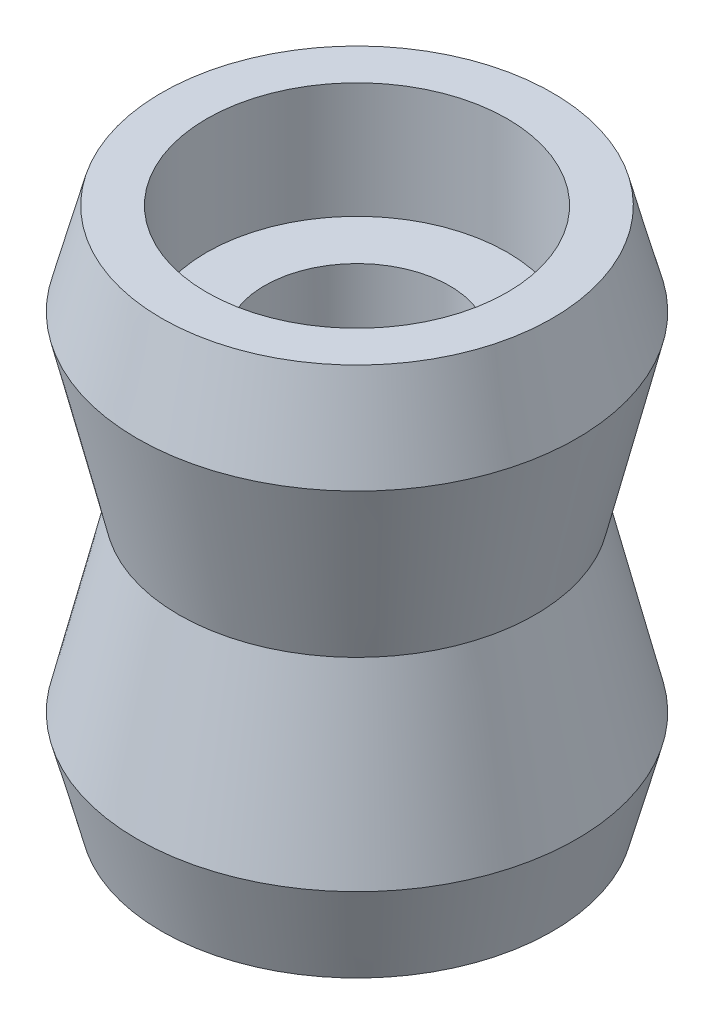
ISO-10303-21;
HEADER;
FILE_DESCRIPTION(('STEP AP214'),'2;1');
FILE_NAME('part.step','',(''),(''),'','','');
FILE_SCHEMA(('AUTOMOTIVE_DESIGN { 1 0 10303 214 1 1 1 1 }'));
ENDSEC;
DATA;
#1=APPLICATION_CONTEXT('core data for automotive mechanical design processes');
#2=APPLICATION_PROTOCOL_DEFINITION('international standard','automotive_design',2000,#1);
#3=PRODUCT_CONTEXT('',#1,'mechanical');
#4=PRODUCT('Part','Part','',(#3));
#5=PRODUCT_RELATED_PRODUCT_CATEGORY('part','',(#4));
#6=PRODUCT_DEFINITION_FORMATION('','',#4);
#7=PRODUCT_DEFINITION_CONTEXT('part definition',#1,'design');
#8=PRODUCT_DEFINITION('design','',#6,#7);
#9=PRODUCT_DEFINITION_SHAPE('','',#8);
#10=(LENGTH_UNIT() NAMED_UNIT(*) SI_UNIT(.MILLI.,.METRE.));
#11=(NAMED_UNIT(*) PLANE_ANGLE_UNIT() SI_UNIT($,.RADIAN.));
#12=(NAMED_UNIT(*) SI_UNIT($,.STERADIAN.) SOLID_ANGLE_UNIT());
#13=UNCERTAINTY_MEASURE_WITH_UNIT(LENGTH_MEASURE(1.E-05),#10,'distance_accuracy_value','');
#14=(GEOMETRIC_REPRESENTATION_CONTEXT(3) GLOBAL_UNCERTAINTY_ASSIGNED_CONTEXT((#13)) GLOBAL_UNIT_ASSIGNED_CONTEXT((#10,
#11,#12)) REPRESENTATION_CONTEXT('',''));
#15=CARTESIAN_POINT('',(0.,0.,0.));
#16=DIRECTION('',(0.,0.,1.));
#17=DIRECTION('',(1.,0.,0.));
#18=AXIS2_PLACEMENT_3D('',#15,#16,#17);
#19=CARTESIAN_POINT('',(0.,42.3234558477177,0.));
#20=DIRECTION('',(0.,1.,0.));
#21=DIRECTION('',(0.,0.,1.));
#22=AXIS2_PLACEMENT_3D('',#19,#20,#21);
#23=CYLINDRICAL_SURFACE('',#22,4.);
#24=CARTESIAN_POINT('',(0.,9.66900053684746,0.));
#25=DIRECTION('',(0.,1.,0.));
#26=DIRECTION('',(0.,0.,1.));
#27=AXIS2_PLACEMENT_3D('',#24,#25,#26);
#28=CIRCLE('',#27,4.);
#29=CARTESIAN_POINT('',(0.,9.66900053684746,4.));
#30=VERTEX_POINT('',#29);
#31=EDGE_CURVE('E63',#30,#30,#28,.T.);
#32=ORIENTED_EDGE('',*,*,#31,.T.);
#33=EDGE_LOOP('',(#32));
#34=FACE_BOUND('',#33,.T.);
#35=CARTESIAN_POINT('',(0.,-3.08436697366508,0.));
#36=DIRECTION('',(0.,-1.,0.));
#37=DIRECTION('',(0.,0.,-1.));
#38=AXIS2_PLACEMENT_3D('',#35,#36,#37);
#39=CIRCLE('',#38,4.);
#40=CARTESIAN_POINT('',(0.,-3.08436697366508,-4.));
#41=VERTEX_POINT('',#40);
#42=EDGE_CURVE('E10',#41,#41,#39,.F.);
#43=ORIENTED_EDGE('',*,*,#42,.F.);
#44=EDGE_LOOP('',(#43));
#45=FACE_BOUND('',#44,.T.);
#46=ADVANCED_FACE('F39',(#34,#45),#23,.F.);
#47=CARTESIAN_POINT('',(0.,-8.28436697366508,0.));
#48=DIRECTION('',(0.,1.,0.));
#49=DIRECTION('',(0.,0.,1.));
#50=AXIS2_PLACEMENT_3D('',#47,#48,#49);
#51=CONICAL_SURFACE('',#50,8.44834512402877,0.258536651886108);
#52=CARTESIAN_POINT('',(0.,-4.30768321840881,0.));
#53=DIRECTION('',(0.,1.,0.));
#54=DIRECTION('',(0.,0.,1.));
#55=AXIS2_PLACEMENT_3D('',#52,#53,#54);
#56=CIRCLE('',#55,9.5);
#57=CARTESIAN_POINT('',(0.,-4.30768321840881,9.5));
#58=VERTEX_POINT('',#57);
#59=EDGE_CURVE('E87',#58,#58,#56,.T.);
#60=ORIENTED_EDGE('',*,*,#59,.F.);
#61=EDGE_LOOP('',(#60));
#62=FACE_BOUND('',#61,.T.);
#63=CARTESIAN_POINT('',(0.,-8.28436697366508,0.));
#64=DIRECTION('',(0.,1.,0.));
#65=DIRECTION('',(0.,0.,1.));
#66=AXIS2_PLACEMENT_3D('',#63,#64,#65);
#67=CIRCLE('',#66,8.44834512402877);
#68=CARTESIAN_POINT('',(0.,-8.28436697366508,8.44834512402877));
#69=VERTEX_POINT('',#68);
#70=EDGE_CURVE('E47',#69,#69,#67,.T.);
#71=ORIENTED_EDGE('',*,*,#70,.T.);
#72=EDGE_LOOP('',(#71));
#73=FACE_BOUND('',#72,.T.);
#74=ADVANCED_FACE('F41',(#62,#73),#51,.T.);
#75=CARTESIAN_POINT('',(6.5,-8.28436697366508,0.));
#76=DIRECTION('',(0.,1.,0.));
#77=DIRECTION('',(0.,0.,1.));
#78=AXIS2_PLACEMENT_3D('',#75,#76,#77);
#79=PLANE('',#78);
#80=ORIENTED_EDGE('',*,*,#70,.F.);
#81=EDGE_LOOP('',(#80));
#82=FACE_BOUND('',#81,.T.);
#83=CARTESIAN_POINT('',(0.,-8.28436697366508,0.));
#84=DIRECTION('',(0.,1.,0.));
#85=DIRECTION('',(0.,0.,1.));
#86=AXIS2_PLACEMENT_3D('',#83,#84,#85);
#87=CIRCLE('',#86,6.5);
#88=CARTESIAN_POINT('',(0.,-8.28436697366508,6.5));
#89=VERTEX_POINT('',#88);
#90=EDGE_CURVE('E52',#89,#89,#87,.T.);
#91=ORIENTED_EDGE('',*,*,#90,.T.);
#92=EDGE_LOOP('',(#91));
#93=FACE_BOUND('',#92,.T.);
#94=ADVANCED_FACE('F95',(#82,#93),#79,.F.);
#95=CARTESIAN_POINT('',(0.,42.3234558477177,0.));
#96=DIRECTION('',(0.,1.,0.));
#97=DIRECTION('',(0.,0.,1.));
#98=AXIS2_PLACEMENT_3D('',#95,#96,#97);
#99=CYLINDRICAL_SURFACE('',#98,6.5);
#100=ORIENTED_EDGE('',*,*,#90,.F.);
#101=EDGE_LOOP('',(#100));
#102=FACE_BOUND('',#101,.T.);
#103=CARTESIAN_POINT('',(0.,-3.28436697366508,0.));
#104=DIRECTION('',(0.,1.,0.));
#105=DIRECTION('',(0.,0.,1.));
#106=AXIS2_PLACEMENT_3D('',#103,#104,#105);
#107=CIRCLE('',#106,6.5);
#108=CARTESIAN_POINT('',(0.,-3.28436697366508,6.5));
#109=VERTEX_POINT('',#108);
#110=EDGE_CURVE('E57',#109,#109,#107,.T.);
#111=ORIENTED_EDGE('',*,*,#110,.T.);
#112=EDGE_LOOP('',(#111));
#113=FACE_BOUND('',#112,.T.);
#114=ADVANCED_FACE('F99',(#102,#113),#99,.F.);
#115=CARTESIAN_POINT('',(4.,-3.28436697366508,0.));
#116=DIRECTION('',(0.,1.,0.));
#117=DIRECTION('',(0.,0.,1.));
#118=AXIS2_PLACEMENT_3D('',#115,#116,#117);
#119=PLANE('',#118);
#120=ORIENTED_EDGE('',*,*,#110,.F.);
#121=EDGE_LOOP('',(#120));
#122=FACE_BOUND('',#121,.T.);
#123=ADVANCED_FACE('F113',(#122),#119,.F.);
#124=CARTESIAN_POINT('',(4.,9.66900053684746,0.));
#125=DIRECTION('',(0.,-1.,0.));
#126=DIRECTION('',(0.,0.,-1.));
#127=AXIS2_PLACEMENT_3D('',#124,#125,#126);
#128=PLANE('',#127);
#129=ORIENTED_EDGE('',*,*,#31,.F.);
#130=EDGE_LOOP('',(#129));
#131=FACE_BOUND('',#130,.T.);
#132=CARTESIAN_POINT('',(0.,9.66900053684746,0.));
#133=DIRECTION('',(0.,1.,0.));
#134=DIRECTION('',(0.,0.,1.));
#135=AXIS2_PLACEMENT_3D('',#132,#133,#134);
#136=CIRCLE('',#135,6.5);
#137=CARTESIAN_POINT('',(0.,9.66900053684746,6.5));
#138=VERTEX_POINT('',#137);
#139=EDGE_CURVE('E67',#138,#138,#136,.T.);
#140=ORIENTED_EDGE('',*,*,#139,.T.);
#141=EDGE_LOOP('',(#140));
#142=FACE_BOUND('',#141,.T.);
#143=ADVANCED_FACE('F111',(#131,#142),#128,.F.);
#144=CARTESIAN_POINT('',(0.,42.3234558477177,0.));
#145=DIRECTION('',(0.,1.,0.));
#146=DIRECTION('',(0.,0.,1.));
#147=AXIS2_PLACEMENT_3D('',#144,#145,#146);
#148=CYLINDRICAL_SURFACE('',#147,6.5);
#149=ORIENTED_EDGE('',*,*,#139,.F.);
#150=EDGE_LOOP('',(#149));
#151=FACE_BOUND('',#150,.T.);
#152=CARTESIAN_POINT('',(0.,14.6690005368475,0.));
#153=DIRECTION('',(0.,1.,0.));
#154=DIRECTION('',(0.,0.,1.));
#155=AXIS2_PLACEMENT_3D('',#152,#153,#154);
#156=CIRCLE('',#155,6.5);
#157=CARTESIAN_POINT('',(0.,14.6690005368475,6.5));
#158=VERTEX_POINT('',#157);
#159=EDGE_CURVE('E71',#158,#158,#156,.T.);
#160=ORIENTED_EDGE('',*,*,#159,.T.);
#161=EDGE_LOOP('',(#160));
#162=FACE_BOUND('',#161,.T.);
#163=ADVANCED_FACE('F133',(#151,#162),#148,.F.);
#164=CARTESIAN_POINT('',(6.5,14.6690005368475,0.));
#165=DIRECTION('',(0.,-1.,0.));
#166=DIRECTION('',(0.,0.,-1.));
#167=AXIS2_PLACEMENT_3D('',#164,#165,#166);
#168=PLANE('',#167);
#169=ORIENTED_EDGE('',*,*,#159,.F.);
#170=EDGE_LOOP('',(#169));
#171=FACE_BOUND('',#170,.T.);
#172=CARTESIAN_POINT('',(0.,14.6690005368475,0.));
#173=DIRECTION('',(0.,1.,0.));
#174=DIRECTION('',(0.,0.,1.));
#175=AXIS2_PLACEMENT_3D('',#172,#173,#174);
#176=CIRCLE('',#175,8.44834512402877);
#177=CARTESIAN_POINT('',(0.,14.6690005368475,8.44834512402877));
#178=VERTEX_POINT('',#177);
#179=EDGE_CURVE('E75',#178,#178,#176,.T.);
#180=ORIENTED_EDGE('',*,*,#179,.T.);
#181=EDGE_LOOP('',(#180));
#182=FACE_BOUND('',#181,.T.);
#183=ADVANCED_FACE('F140',(#171,#182),#168,.F.);
#184=CARTESIAN_POINT('',(0.,10.6923167815912,0.));
#185=DIRECTION('',(0.,-1.,0.));
#186=DIRECTION('',(0.,0.,-1.));
#187=AXIS2_PLACEMENT_3D('',#184,#185,#186);
#188=CONICAL_SURFACE('',#187,9.5,0.258536651886108);
#189=ORIENTED_EDGE('',*,*,#179,.F.);
#190=EDGE_LOOP('',(#189));
#191=FACE_BOUND('',#190,.T.);
#192=CARTESIAN_POINT('',(0.,10.6923167815912,0.));
#193=DIRECTION('',(0.,1.,0.));
#194=DIRECTION('',(0.,0.,1.));
#195=AXIS2_PLACEMENT_3D('',#192,#193,#194);
#196=CIRCLE('',#195,9.5);
#197=CARTESIAN_POINT('',(0.,10.6923167815912,9.5));
#198=VERTEX_POINT('',#197);
#199=EDGE_CURVE('E79',#198,#198,#196,.T.);
#200=ORIENTED_EDGE('',*,*,#199,.T.);
#201=EDGE_LOOP('',(#200));
#202=FACE_BOUND('',#201,.T.);
#203=ADVANCED_FACE('F147',(#191,#202),#188,.T.);
#204=CARTESIAN_POINT('',(0.,3.19231678159119,0.));
#205=DIRECTION('',(0.,1.,0.));
#206=DIRECTION('',(0.,0.,1.));
#207=AXIS2_PLACEMENT_3D('',#204,#205,#206);
#208=CONICAL_SURFACE('',#207,7.7,0.235544980720863);
#209=ORIENTED_EDGE('',*,*,#199,.F.);
#210=EDGE_LOOP('',(#209));
#211=FACE_BOUND('',#210,.T.);
#212=CARTESIAN_POINT('',(0.,3.19231678159119,0.));
#213=DIRECTION('',(0.,1.,0.));
#214=DIRECTION('',(0.,0.,1.));
#215=AXIS2_PLACEMENT_3D('',#212,#213,#214);
#216=CIRCLE('',#215,7.7);
#217=CARTESIAN_POINT('',(0.,3.19231678159119,7.7));
#218=VERTEX_POINT('',#217);
#219=EDGE_CURVE('E83',#218,#218,#216,.T.);
#220=ORIENTED_EDGE('',*,*,#219,.T.);
#221=EDGE_LOOP('',(#220));
#222=FACE_BOUND('',#221,.T.);
#223=ADVANCED_FACE('F155',(#211,#222),#208,.T.);
#224=CARTESIAN_POINT('',(0.,-4.30768321840881,0.));
#225=DIRECTION('',(0.,-1.,0.));
#226=DIRECTION('',(0.,0.,-1.));
#227=AXIS2_PLACEMENT_3D('',#224,#225,#226);
#228=CONICAL_SURFACE('',#227,9.5,0.235544980720863);
#229=ORIENTED_EDGE('',*,*,#219,.F.);
#230=EDGE_LOOP('',(#229));
#231=FACE_BOUND('',#230,.T.);
#232=ORIENTED_EDGE('',*,*,#59,.T.);
#233=EDGE_LOOP('',(#232));
#234=FACE_BOUND('',#233,.T.);
#235=ADVANCED_FACE('F92',(#231,#234),#228,.T.);
#236=CARTESIAN_POINT('',(0.,-3.08436697366508,0.));
#237=DIRECTION('',(0.,-1.,0.));
#238=DIRECTION('',(0.,0.,-1.));
#239=AXIS2_PLACEMENT_3D('',#236,#237,#238);
#240=PLANE('',#239);
#241=ORIENTED_EDGE('',*,*,#42,.T.);
#242=EDGE_LOOP('',(#241));
#243=FACE_BOUND('',#242,.T.);
#244=ADVANCED_FACE('F169',(#243),#240,.F.);
#245=CLOSED_SHELL('',(#46,#74,#94,#114,#123,#143,#163,#183,#203,#223,#235,#244));
#246=MANIFOLD_SOLID_BREP('B2',#245);
#247=ADVANCED_BREP_SHAPE_REPRESENTATION('',(#18,#246),#14);
#248=SHAPE_DEFINITION_REPRESENTATION(#9,#247);
ENDSEC;
END-ISO-10303-21;
